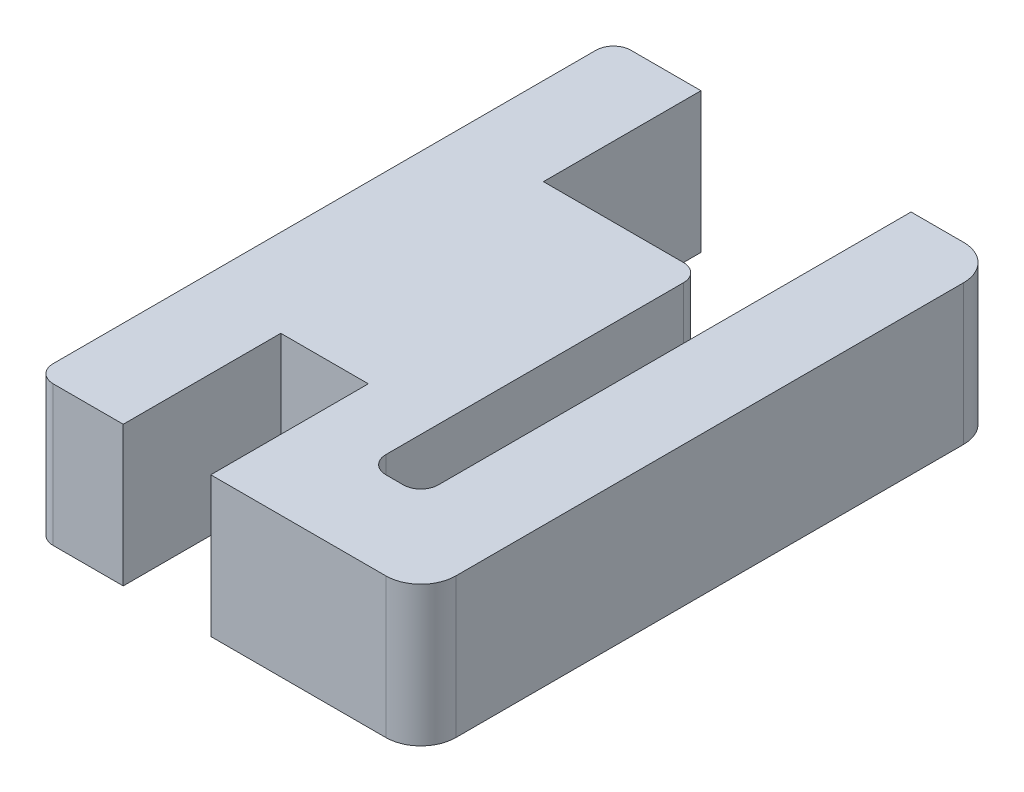
ISO-10303-21;
HEADER;
FILE_DESCRIPTION(('STEP AP214'),'2;1');
FILE_NAME('part.step','',(''),(''),'','','');
FILE_SCHEMA(('AUTOMOTIVE_DESIGN { 1 0 10303 214 1 1 1 1 }'));
ENDSEC;
DATA;
#1=APPLICATION_CONTEXT('core data for automotive mechanical design processes');
#2=APPLICATION_PROTOCOL_DEFINITION('international standard','automotive_design',2000,#1);
#3=PRODUCT_CONTEXT('',#1,'mechanical');
#4=PRODUCT('Part','Part','',(#3));
#5=PRODUCT_RELATED_PRODUCT_CATEGORY('part','',(#4));
#6=PRODUCT_DEFINITION_FORMATION('','',#4);
#7=PRODUCT_DEFINITION_CONTEXT('part definition',#1,'design');
#8=PRODUCT_DEFINITION('design','',#6,#7);
#9=PRODUCT_DEFINITION_SHAPE('','',#8);
#10=(LENGTH_UNIT() NAMED_UNIT(*) SI_UNIT(.MILLI.,.METRE.));
#11=(NAMED_UNIT(*) PLANE_ANGLE_UNIT() SI_UNIT($,.RADIAN.));
#12=(NAMED_UNIT(*) SI_UNIT($,.STERADIAN.) SOLID_ANGLE_UNIT());
#13=UNCERTAINTY_MEASURE_WITH_UNIT(LENGTH_MEASURE(1.E-05),#10,'distance_accuracy_value','');
#14=(GEOMETRIC_REPRESENTATION_CONTEXT(3) GLOBAL_UNCERTAINTY_ASSIGNED_CONTEXT((#13)) GLOBAL_UNIT_ASSIGNED_CONTEXT((#10,
#11,#12)) REPRESENTATION_CONTEXT('',''));
#15=CARTESIAN_POINT('',(0.,0.,0.));
#16=DIRECTION('',(0.,0.,1.));
#17=DIRECTION('',(1.,0.,0.));
#18=AXIS2_PLACEMENT_3D('',#15,#16,#17);
#19=CARTESIAN_POINT('',(0.,4.,-2.5));
#20=DIRECTION('',(0.,0.,1.));
#21=DIRECTION('',(1.,0.,0.));
#22=AXIS2_PLACEMENT_3D('',#19,#20,#21);
#23=PLANE('',#22);
#24=DIRECTION('',(-1.,0.,0.));
#25=VECTOR('',#24,1.);
#26=CARTESIAN_POINT('',(0.,4.,-2.5));
#27=LINE('',#26,#25);
#28=CARTESIAN_POINT('',(8.00000000000001,4.,-2.5));
#29=VERTEX_POINT('',#28);
#30=CARTESIAN_POINT('',(7.50000000000001,4.,-2.5));
#31=VERTEX_POINT('',#30);
#32=EDGE_CURVE('E210',#29,#31,#27,.T.);
#33=ORIENTED_EDGE('',*,*,#32,.F.);
#34=DIRECTION('',(0.,-1.,0.));
#35=VECTOR('',#34,1.);
#36=CARTESIAN_POINT('',(8.00000000000001,0.,-2.5));
#37=LINE('',#36,#35);
#38=CARTESIAN_POINT('',(8.00000000000001,0.,-2.5));
#39=VERTEX_POINT('',#38);
#40=EDGE_CURVE('E284',#29,#39,#37,.T.);
#41=ORIENTED_EDGE('',*,*,#40,.T.);
#42=DIRECTION('',(-1.,0.,0.));
#43=VECTOR('',#42,1.);
#44=CARTESIAN_POINT('',(0.,0.,-2.5));
#45=LINE('',#44,#43);
#46=CARTESIAN_POINT('',(7.50000000000001,0.,-2.5));
#47=VERTEX_POINT('',#46);
#48=EDGE_CURVE('E236',#39,#47,#45,.T.);
#49=ORIENTED_EDGE('',*,*,#48,.T.);
#50=DIRECTION('',(0.,-1.,0.));
#51=VECTOR('',#50,1.);
#52=CARTESIAN_POINT('',(7.50000000000001,4.,-2.5));
#53=LINE('',#52,#51);
#54=EDGE_CURVE('E193',#47,#31,#53,.F.);
#55=ORIENTED_EDGE('',*,*,#54,.T.);
#56=EDGE_LOOP('',(#33,#41,#49,#55));
#57=FACE_BOUND('',#56,.T.);
#58=ADVANCED_FACE('F35',(#57),#23,.F.);
#59=CARTESIAN_POINT('',(7.00000000000001,4.,0.));
#60=DIRECTION('',(-1.,0.,0.));
#61=DIRECTION('',(0.,0.,1.));
#62=AXIS2_PLACEMENT_3D('',#59,#60,#61);
#63=PLANE('',#62);
#64=DIRECTION('',(0.,0.,-1.));
#65=VECTOR('',#64,1.);
#66=CARTESIAN_POINT('',(7.00000000000001,4.,0.));
#67=LINE('',#66,#65);
#68=CARTESIAN_POINT('',(7.00000000000001,4.,-3.));
#69=VERTEX_POINT('',#68);
#70=CARTESIAN_POINT('',(7.00000000000001,4.,-11.5));
#71=VERTEX_POINT('',#70);
#72=EDGE_CURVE('E208',#69,#71,#67,.T.);
#73=ORIENTED_EDGE('',*,*,#72,.F.);
#74=DIRECTION('',(0.,-1.,0.));
#75=VECTOR('',#74,1.);
#76=CARTESIAN_POINT('',(7.00000000000001,0.,-3.));
#77=LINE('',#76,#75);
#78=CARTESIAN_POINT('',(7.00000000000001,0.,-3.));
#79=VERTEX_POINT('',#78);
#80=EDGE_CURVE('E291',#69,#79,#77,.T.);
#81=ORIENTED_EDGE('',*,*,#80,.T.);
#82=DIRECTION('',(0.,0.,-1.));
#83=VECTOR('',#82,1.);
#84=CARTESIAN_POINT('',(7.00000000000001,0.,0.));
#85=LINE('',#84,#83);
#86=CARTESIAN_POINT('',(7.00000000000001,0.,-11.5));
#87=VERTEX_POINT('',#86);
#88=EDGE_CURVE('E239',#79,#87,#85,.T.);
#89=ORIENTED_EDGE('',*,*,#88,.T.);
#90=DIRECTION('',(0.,-1.,0.));
#91=VECTOR('',#90,1.);
#92=CARTESIAN_POINT('',(7.00000000000001,4.,-11.5));
#93=LINE('',#92,#91);
#94=EDGE_CURVE('E289',#87,#71,#93,.F.);
#95=ORIENTED_EDGE('',*,*,#94,.T.);
#96=EDGE_LOOP('',(#73,#81,#89,#95));
#97=FACE_BOUND('',#96,.T.);
#98=ADVANCED_FACE('F390',(#97),#63,.F.);
#99=CARTESIAN_POINT('',(0.,4.,-12.));
#100=DIRECTION('',(0.,0.,-1.));
#101=DIRECTION('',(-1.,0.,0.));
#102=AXIS2_PLACEMENT_3D('',#99,#100,#101);
#103=PLANE('',#102);
#104=DIRECTION('',(1.,0.,0.));
#105=VECTOR('',#104,1.);
#106=CARTESIAN_POINT('',(0.,4.,-12.));
#107=LINE('',#106,#105);
#108=CARTESIAN_POINT('',(2.50000000000001,4.,-12.));
#109=VERTEX_POINT('',#108);
#110=CARTESIAN_POINT('',(6.50000000000001,4.,-12.));
#111=VERTEX_POINT('',#110);
#112=EDGE_CURVE('E186',#109,#111,#107,.T.);
#113=ORIENTED_EDGE('',*,*,#112,.T.);
#114=DIRECTION('',(0.,-1.,0.));
#115=VECTOR('',#114,1.);
#116=CARTESIAN_POINT('',(6.50000000000001,0.,-12.));
#117=LINE('',#116,#115);
#118=CARTESIAN_POINT('',(6.50000000000001,0.,-12.));
#119=VERTEX_POINT('',#118);
#120=EDGE_CURVE('E294',#111,#119,#117,.T.);
#121=ORIENTED_EDGE('',*,*,#120,.T.);
#122=DIRECTION('',(1.,0.,0.));
#123=VECTOR('',#122,1.);
#124=CARTESIAN_POINT('',(0.,0.,-12.));
#125=LINE('',#124,#123);
#126=CARTESIAN_POINT('',(2.50000000000001,0.,-12.));
#127=VERTEX_POINT('',#126);
#128=EDGE_CURVE('E189',#127,#119,#125,.T.);
#129=ORIENTED_EDGE('',*,*,#128,.F.);
#130=DIRECTION('',(0.,-1.,0.));
#131=VECTOR('',#130,1.);
#132=CARTESIAN_POINT('',(2.50000000000001,4.,-12.));
#133=LINE('',#132,#131);
#134=EDGE_CURVE('E181',#109,#127,#133,.T.);
#135=ORIENTED_EDGE('',*,*,#134,.F.);
#136=EDGE_LOOP('',(#113,#121,#129,#135));
#137=FACE_BOUND('',#136,.T.);
#138=ADVANCED_FACE('F183',(#137),#103,.T.);
#139=CARTESIAN_POINT('',(2.50000000000002,4.,0.));
#140=DIRECTION('',(-1.,0.,0.));
#141=DIRECTION('',(0.,0.,1.));
#142=AXIS2_PLACEMENT_3D('',#139,#140,#141);
#143=PLANE('',#142);
#144=DIRECTION('',(0.,0.,-1.));
#145=VECTOR('',#144,1.);
#146=CARTESIAN_POINT('',(2.50000000000002,0.,0.));
#147=LINE('',#146,#145);
#148=CARTESIAN_POINT('',(2.5,0.,-16.5));
#149=VERTEX_POINT('',#148);
#150=EDGE_CURVE('E243',#127,#149,#147,.T.);
#151=ORIENTED_EDGE('',*,*,#150,.T.);
#152=DIRECTION('',(0.,-1.,0.));
#153=VECTOR('',#152,1.);
#154=CARTESIAN_POINT('',(2.5,4.,-16.5));
#155=LINE('',#154,#153);
#156=CARTESIAN_POINT('',(2.5,4.,-16.5));
#157=VERTEX_POINT('',#156);
#158=EDGE_CURVE('E194',#157,#149,#155,.T.);
#159=ORIENTED_EDGE('',*,*,#158,.F.);
#160=DIRECTION('',(0.,0.,-1.));
#161=VECTOR('',#160,1.);
#162=CARTESIAN_POINT('',(2.50000000000002,4.,0.));
#163=LINE('',#162,#161);
#164=EDGE_CURVE('E198',#109,#157,#163,.T.);
#165=ORIENTED_EDGE('',*,*,#164,.F.);
#166=ORIENTED_EDGE('',*,*,#134,.T.);
#167=EDGE_LOOP('',(#151,#159,#165,#166));
#168=FACE_BOUND('',#167,.T.);
#169=ADVANCED_FACE('F199',(#168),#143,.F.);
#170=CARTESIAN_POINT('',(0.,4.,-16.5));
#171=DIRECTION('',(0.,0.,-1.));
#172=DIRECTION('',(-1.,0.,0.));
#173=AXIS2_PLACEMENT_3D('',#170,#171,#172);
#174=PLANE('',#173);
#175=DIRECTION('',(1.,0.,0.));
#176=VECTOR('',#175,1.);
#177=CARTESIAN_POINT('',(0.,0.,-16.5));
#178=LINE('',#177,#176);
#179=CARTESIAN_POINT('',(0.5,0.,-16.5));
#180=VERTEX_POINT('',#179);
#181=EDGE_CURVE('E245',#180,#149,#178,.T.);
#182=ORIENTED_EDGE('',*,*,#181,.F.);
#183=DIRECTION('',(0.,-1.,0.));
#184=VECTOR('',#183,1.);
#185=CARTESIAN_POINT('',(0.5,4.,-16.5));
#186=LINE('',#185,#184);
#187=CARTESIAN_POINT('',(0.5,4.,-16.5));
#188=VERTEX_POINT('',#187);
#189=EDGE_CURVE('E315',#180,#188,#186,.F.);
#190=ORIENTED_EDGE('',*,*,#189,.T.);
#191=DIRECTION('',(1.,0.,0.));
#192=VECTOR('',#191,1.);
#193=CARTESIAN_POINT('',(0.,4.,-16.5));
#194=LINE('',#193,#192);
#195=EDGE_CURVE('E202',#188,#157,#194,.T.);
#196=ORIENTED_EDGE('',*,*,#195,.T.);
#197=ORIENTED_EDGE('',*,*,#158,.T.);
#198=EDGE_LOOP('',(#182,#190,#196,#197));
#199=FACE_BOUND('',#198,.T.);
#200=ADVANCED_FACE('F384',(#199),#174,.T.);
#201=CARTESIAN_POINT('',(0.,4.,0.));
#202=DIRECTION('',(-1.,0.,0.));
#203=DIRECTION('',(0.,0.,1.));
#204=AXIS2_PLACEMENT_3D('',#201,#202,#203);
#205=PLANE('',#204);
#206=DIRECTION('',(0.,0.,-1.));
#207=VECTOR('',#206,1.);
#208=CARTESIAN_POINT('',(0.,0.,0.));
#209=LINE('',#208,#207);
#210=CARTESIAN_POINT('',(0.,0.,-0.5));
#211=VERTEX_POINT('',#210);
#212=CARTESIAN_POINT('',(0.,0.,-16.));
#213=VERTEX_POINT('',#212);
#214=EDGE_CURVE('E247',#211,#213,#209,.T.);
#215=ORIENTED_EDGE('',*,*,#214,.F.);
#216=DIRECTION('',(0.,-1.,0.));
#217=VECTOR('',#216,1.);
#218=CARTESIAN_POINT('',(0.,4.,-0.5));
#219=LINE('',#218,#217);
#220=CARTESIAN_POINT('',(0.,4.,-0.5));
#221=VERTEX_POINT('',#220);
#222=EDGE_CURVE('E313',#211,#221,#219,.F.);
#223=ORIENTED_EDGE('',*,*,#222,.T.);
#224=DIRECTION('',(0.,0.,-1.));
#225=VECTOR('',#224,1.);
#226=CARTESIAN_POINT('',(0.,4.,0.));
#227=LINE('',#226,#225);
#228=CARTESIAN_POINT('',(0.,4.,-16.));
#229=VERTEX_POINT('',#228);
#230=EDGE_CURVE('E215',#221,#229,#227,.T.);
#231=ORIENTED_EDGE('',*,*,#230,.T.);
#232=DIRECTION('',(0.,-1.,0.));
#233=VECTOR('',#232,1.);
#234=CARTESIAN_POINT('',(0.,4.,-16.));
#235=LINE('',#234,#233);
#236=EDGE_CURVE('E310',#229,#213,#235,.T.);
#237=ORIENTED_EDGE('',*,*,#236,.T.);
#238=EDGE_LOOP('',(#215,#223,#231,#237));
#239=FACE_BOUND('',#238,.T.);
#240=ADVANCED_FACE('F373',(#239),#205,.T.);
#241=CARTESIAN_POINT('',(0.,4.,0.));
#242=DIRECTION('',(0.,0.,-1.));
#243=DIRECTION('',(-1.,0.,0.));
#244=AXIS2_PLACEMENT_3D('',#241,#242,#243);
#245=PLANE('',#244);
#246=DIRECTION('',(1.,0.,0.));
#247=VECTOR('',#246,1.);
#248=CARTESIAN_POINT('',(0.,4.,0.));
#249=LINE('',#248,#247);
#250=CARTESIAN_POINT('',(0.5,4.,0.));
#251=VERTEX_POINT('',#250);
#252=CARTESIAN_POINT('',(2.5,4.,0.));
#253=VERTEX_POINT('',#252);
#254=EDGE_CURVE('E218',#251,#253,#249,.T.);
#255=ORIENTED_EDGE('',*,*,#254,.F.);
#256=DIRECTION('',(0.,-1.,0.));
#257=VECTOR('',#256,1.);
#258=CARTESIAN_POINT('',(0.5,0.,0.));
#259=LINE('',#258,#257);
#260=CARTESIAN_POINT('',(0.5,0.,0.));
#261=VERTEX_POINT('',#260);
#262=EDGE_CURVE('E307',#251,#261,#259,.T.);
#263=ORIENTED_EDGE('',*,*,#262,.T.);
#264=DIRECTION('',(1.,0.,0.));
#265=VECTOR('',#264,1.);
#266=CARTESIAN_POINT('',(0.,0.,0.));
#267=LINE('',#266,#265);
#268=CARTESIAN_POINT('',(2.5,0.,0.));
#269=VERTEX_POINT('',#268);
#270=EDGE_CURVE('E250',#261,#269,#267,.T.);
#271=ORIENTED_EDGE('',*,*,#270,.T.);
#272=DIRECTION('',(0.,-1.,0.));
#273=VECTOR('',#272,1.);
#274=CARTESIAN_POINT('',(2.5,4.,0.));
#275=LINE('',#274,#273);
#276=EDGE_CURVE('E279',#253,#269,#275,.T.);
#277=ORIENTED_EDGE('',*,*,#276,.F.);
#278=EDGE_LOOP('',(#255,#263,#271,#277));
#279=FACE_BOUND('',#278,.T.);
#280=ADVANCED_FACE('F367',(#279),#245,.F.);
#281=CARTESIAN_POINT('',(2.5,4.,0.));
#282=DIRECTION('',(-1.,0.,0.));
#283=DIRECTION('',(0.,0.,1.));
#284=AXIS2_PLACEMENT_3D('',#281,#282,#283);
#285=PLANE('',#284);
#286=DIRECTION('',(0.,0.,-1.));
#287=VECTOR('',#286,1.);
#288=CARTESIAN_POINT('',(2.5,0.,0.));
#289=LINE('',#288,#287);
#290=CARTESIAN_POINT('',(2.50000000000001,0.,-4.5));
#291=VERTEX_POINT('',#290);
#292=EDGE_CURVE('E252',#269,#291,#289,.T.);
#293=ORIENTED_EDGE('',*,*,#292,.T.);
#294=DIRECTION('',(0.,-1.,0.));
#295=VECTOR('',#294,1.);
#296=CARTESIAN_POINT('',(2.50000000000001,4.,-4.5));
#297=LINE('',#296,#295);
#298=CARTESIAN_POINT('',(2.50000000000001,4.,-4.5));
#299=VERTEX_POINT('',#298);
#300=EDGE_CURVE('E276',#299,#291,#297,.T.);
#301=ORIENTED_EDGE('',*,*,#300,.F.);
#302=DIRECTION('',(0.,0.,-1.));
#303=VECTOR('',#302,1.);
#304=CARTESIAN_POINT('',(2.5,4.,0.));
#305=LINE('',#304,#303);
#306=EDGE_CURVE('E220',#253,#299,#305,.T.);
#307=ORIENTED_EDGE('',*,*,#306,.F.);
#308=ORIENTED_EDGE('',*,*,#276,.T.);
#309=EDGE_LOOP('',(#293,#301,#307,#308));
#310=FACE_BOUND('',#309,.T.);
#311=ADVANCED_FACE('F363',(#310),#285,.F.);
#312=CARTESIAN_POINT('',(0.,4.,-4.5));
#313=DIRECTION('',(0.,0.,-1.));
#314=DIRECTION('',(-1.,0.,0.));
#315=AXIS2_PLACEMENT_3D('',#312,#313,#314);
#316=PLANE('',#315);
#317=DIRECTION('',(1.,0.,0.));
#318=VECTOR('',#317,1.);
#319=CARTESIAN_POINT('',(0.,0.,-4.5));
#320=LINE('',#319,#318);
#321=CARTESIAN_POINT('',(5.00000000000001,0.,-4.5));
#322=VERTEX_POINT('',#321);
#323=EDGE_CURVE('E254',#291,#322,#320,.T.);
#324=ORIENTED_EDGE('',*,*,#323,.T.);
#325=DIRECTION('',(0.,-1.,0.));
#326=VECTOR('',#325,1.);
#327=CARTESIAN_POINT('',(5.00000000000001,4.,-4.5));
#328=LINE('',#327,#326);
#329=CARTESIAN_POINT('',(5.00000000000001,4.,-4.5));
#330=VERTEX_POINT('',#329);
#331=EDGE_CURVE('E273',#330,#322,#328,.T.);
#332=ORIENTED_EDGE('',*,*,#331,.F.);
#333=DIRECTION('',(1.,0.,0.));
#334=VECTOR('',#333,1.);
#335=CARTESIAN_POINT('',(0.,4.,-4.5));
#336=LINE('',#335,#334);
#337=EDGE_CURVE('E222',#299,#330,#336,.T.);
#338=ORIENTED_EDGE('',*,*,#337,.F.);
#339=ORIENTED_EDGE('',*,*,#300,.T.);
#340=EDGE_LOOP('',(#324,#332,#338,#339));
#341=FACE_BOUND('',#340,.T.);
#342=ADVANCED_FACE('F358',(#341),#316,.F.);
#343=CARTESIAN_POINT('',(5.00000000000001,4.,0.));
#344=DIRECTION('',(1.,0.,0.));
#345=DIRECTION('',(0.,0.,-1.));
#346=AXIS2_PLACEMENT_3D('',#343,#344,#345);
#347=PLANE('',#346);
#348=DIRECTION('',(0.,0.,1.));
#349=VECTOR('',#348,1.);
#350=CARTESIAN_POINT('',(5.00000000000001,0.,0.));
#351=LINE('',#350,#349);
#352=CARTESIAN_POINT('',(5.00000000000001,0.,0.));
#353=VERTEX_POINT('',#352);
#354=EDGE_CURVE('E256',#322,#353,#351,.T.);
#355=ORIENTED_EDGE('',*,*,#354,.T.);
#356=DIRECTION('',(0.,-1.,0.));
#357=VECTOR('',#356,1.);
#358=CARTESIAN_POINT('',(5.00000000000001,4.,0.));
#359=LINE('',#358,#357);
#360=CARTESIAN_POINT('',(5.00000000000001,4.,0.));
#361=VERTEX_POINT('',#360);
#362=EDGE_CURVE('E270',#361,#353,#359,.T.);
#363=ORIENTED_EDGE('',*,*,#362,.F.);
#364=DIRECTION('',(0.,0.,1.));
#365=VECTOR('',#364,1.);
#366=CARTESIAN_POINT('',(5.00000000000001,4.,0.));
#367=LINE('',#366,#365);
#368=EDGE_CURVE('E224',#330,#361,#367,.T.);
#369=ORIENTED_EDGE('',*,*,#368,.F.);
#370=ORIENTED_EDGE('',*,*,#331,.T.);
#371=EDGE_LOOP('',(#355,#363,#369,#370));
#372=FACE_BOUND('',#371,.T.);
#373=ADVANCED_FACE('F352',(#372),#347,.F.);
#374=CARTESIAN_POINT('',(0.,4.,0.));
#375=DIRECTION('',(0.,0.,-1.));
#376=DIRECTION('',(-1.,0.,0.));
#377=AXIS2_PLACEMENT_3D('',#374,#375,#376);
#378=PLANE('',#377);
#379=DIRECTION('',(1.,0.,0.));
#380=VECTOR('',#379,1.);
#381=CARTESIAN_POINT('',(0.,0.,0.));
#382=LINE('',#381,#380);
#383=CARTESIAN_POINT('',(10.,0.,0.));
#384=VERTEX_POINT('',#383);
#385=EDGE_CURVE('E258',#353,#384,#382,.T.);
#386=ORIENTED_EDGE('',*,*,#385,.T.);
#387=DIRECTION('',(0.,-1.,0.));
#388=VECTOR('',#387,1.);
#389=CARTESIAN_POINT('',(10.,4.,0.));
#390=LINE('',#389,#388);
#391=CARTESIAN_POINT('',(10.,4.,0.));
#392=VERTEX_POINT('',#391);
#393=EDGE_CURVE('E58',#384,#392,#390,.F.);
#394=ORIENTED_EDGE('',*,*,#393,.T.);
#395=DIRECTION('',(1.,0.,0.));
#396=VECTOR('',#395,1.);
#397=CARTESIAN_POINT('',(0.,4.,0.));
#398=LINE('',#397,#396);
#399=EDGE_CURVE('E226',#361,#392,#398,.T.);
#400=ORIENTED_EDGE('',*,*,#399,.F.);
#401=ORIENTED_EDGE('',*,*,#362,.T.);
#402=EDGE_LOOP('',(#386,#394,#400,#401));
#403=FACE_BOUND('',#402,.T.);
#404=ADVANCED_FACE('F348',(#403),#378,.F.);
#405=CARTESIAN_POINT('',(11.,4.,0.));
#406=DIRECTION('',(-1.,0.,0.));
#407=DIRECTION('',(0.,0.,1.));
#408=AXIS2_PLACEMENT_3D('',#405,#406,#407);
#409=PLANE('',#408);
#410=DIRECTION('',(0.,0.,-1.));
#411=VECTOR('',#410,1.);
#412=CARTESIAN_POINT('',(11.,4.,0.));
#413=LINE('',#412,#411);
#414=CARTESIAN_POINT('',(11.,4.,-1.));
#415=VERTEX_POINT('',#414);
#416=CARTESIAN_POINT('',(11.,4.,-15.5));
#417=VERTEX_POINT('',#416);
#418=EDGE_CURVE('E228',#415,#417,#413,.T.);
#419=ORIENTED_EDGE('',*,*,#418,.F.);
#420=DIRECTION('',(0.,-1.,0.));
#421=VECTOR('',#420,1.);
#422=CARTESIAN_POINT('',(11.,4.,-1.));
#423=LINE('',#422,#421);
#424=CARTESIAN_POINT('',(11.,0.,-1.));
#425=VERTEX_POINT('',#424);
#426=EDGE_CURVE('E327',#415,#425,#423,.T.);
#427=ORIENTED_EDGE('',*,*,#426,.T.);
#428=DIRECTION('',(0.,0.,-1.));
#429=VECTOR('',#428,1.);
#430=CARTESIAN_POINT('',(11.,0.,0.));
#431=LINE('',#430,#429);
#432=CARTESIAN_POINT('',(11.,0.,-15.5));
#433=VERTEX_POINT('',#432);
#434=EDGE_CURVE('E260',#425,#433,#431,.T.);
#435=ORIENTED_EDGE('',*,*,#434,.T.);
#436=DIRECTION('',(0.,-1.,0.));
#437=VECTOR('',#436,1.);
#438=CARTESIAN_POINT('',(11.,4.,-15.5));
#439=LINE('',#438,#437);
#440=EDGE_CURVE('E325',#433,#417,#439,.F.);
#441=ORIENTED_EDGE('',*,*,#440,.T.);
#442=EDGE_LOOP('',(#419,#427,#435,#441));
#443=FACE_BOUND('',#442,.T.);
#444=ADVANCED_FACE('F340',(#443),#409,.F.);
#445=CARTESIAN_POINT('',(0.,4.,-16.5));
#446=DIRECTION('',(0.,0.,1.));
#447=DIRECTION('',(1.,0.,0.));
#448=AXIS2_PLACEMENT_3D('',#445,#446,#447);
#449=PLANE('',#448);
#450=DIRECTION('',(-1.,0.,0.));
#451=VECTOR('',#450,1.);
#452=CARTESIAN_POINT('',(0.,4.,-16.5));
#453=LINE('',#452,#451);
#454=CARTESIAN_POINT('',(10.,4.,-16.5));
#455=VERTEX_POINT('',#454);
#456=CARTESIAN_POINT('',(8.50000000000001,4.,-16.5));
#457=VERTEX_POINT('',#456);
#458=EDGE_CURVE('E230',#455,#457,#453,.T.);
#459=ORIENTED_EDGE('',*,*,#458,.F.);
#460=DIRECTION('',(0.,-1.,0.));
#461=VECTOR('',#460,1.);
#462=CARTESIAN_POINT('',(10.,4.,-16.5));
#463=LINE('',#462,#461);
#464=CARTESIAN_POINT('',(10.,0.,-16.5));
#465=VERTEX_POINT('',#464);
#466=EDGE_CURVE('E11',#455,#465,#463,.T.);
#467=ORIENTED_EDGE('',*,*,#466,.T.);
#468=DIRECTION('',(-1.,0.,0.));
#469=VECTOR('',#468,1.);
#470=CARTESIAN_POINT('',(0.,0.,-16.5));
#471=LINE('',#470,#469);
#472=CARTESIAN_POINT('',(8.50000000000001,0.,-16.5));
#473=VERTEX_POINT('',#472);
#474=EDGE_CURVE('E263',#465,#473,#471,.T.);
#475=ORIENTED_EDGE('',*,*,#474,.T.);
#476=DIRECTION('',(0.,-1.,0.));
#477=VECTOR('',#476,1.);
#478=CARTESIAN_POINT('',(8.50000000000001,4.,-16.5));
#479=LINE('',#478,#477);
#480=EDGE_CURVE('E235',#457,#473,#479,.T.);
#481=ORIENTED_EDGE('',*,*,#480,.F.);
#482=EDGE_LOOP('',(#459,#467,#475,#481));
#483=FACE_BOUND('',#482,.T.);
#484=ADVANCED_FACE('F434',(#483),#449,.F.);
#485=CARTESIAN_POINT('',(8.50000000000001,4.,0.));
#486=DIRECTION('',(1.,0.,0.));
#487=DIRECTION('',(0.,0.,-1.));
#488=AXIS2_PLACEMENT_3D('',#485,#486,#487);
#489=PLANE('',#488);
#490=DIRECTION('',(0.,0.,1.));
#491=VECTOR('',#490,1.);
#492=CARTESIAN_POINT('',(8.50000000000001,0.,0.));
#493=LINE('',#492,#491);
#494=CARTESIAN_POINT('',(8.50000000000001,0.,-3.));
#495=VERTEX_POINT('',#494);
#496=EDGE_CURVE('E265',#473,#495,#493,.T.);
#497=ORIENTED_EDGE('',*,*,#496,.T.);
#498=DIRECTION('',(0.,-1.,0.));
#499=VECTOR('',#498,1.);
#500=CARTESIAN_POINT('',(8.50000000000001,4.,-3.));
#501=LINE('',#500,#499);
#502=CARTESIAN_POINT('',(8.50000000000001,4.,-3.));
#503=VERTEX_POINT('',#502);
#504=EDGE_CURVE('E287',#495,#503,#501,.F.);
#505=ORIENTED_EDGE('',*,*,#504,.T.);
#506=DIRECTION('',(0.,0.,1.));
#507=VECTOR('',#506,1.);
#508=CARTESIAN_POINT('',(8.50000000000001,4.,0.));
#509=LINE('',#508,#507);
#510=EDGE_CURVE('E232',#457,#503,#509,.T.);
#511=ORIENTED_EDGE('',*,*,#510,.F.);
#512=ORIENTED_EDGE('',*,*,#480,.T.);
#513=EDGE_LOOP('',(#497,#505,#511,#512));
#514=FACE_BOUND('',#513,.T.);
#515=ADVANCED_FACE('F431',(#514),#489,.F.);
#516=CARTESIAN_POINT('',(0.,4.,0.));
#517=DIRECTION('',(0.,1.,0.));
#518=DIRECTION('',(0.,0.,1.));
#519=AXIS2_PLACEMENT_3D('',#516,#517,#518);
#520=PLANE('',#519);
#521=ORIENTED_EDGE('',*,*,#399,.T.);
#522=CARTESIAN_POINT('',(10.,4.,-1.));
#523=DIRECTION('',(0.,1.,0.));
#524=DIRECTION('',(0.,0.,1.));
#525=AXIS2_PLACEMENT_3D('',#522,#523,#524);
#526=CIRCLE('',#525,1.);
#527=EDGE_CURVE('E43',#392,#415,#526,.T.);
#528=ORIENTED_EDGE('',*,*,#527,.T.);
#529=ORIENTED_EDGE('',*,*,#418,.T.);
#530=CARTESIAN_POINT('',(10.,4.,-15.5));
#531=DIRECTION('',(0.,1.,0.));
#532=DIRECTION('',(0.,0.,1.));
#533=AXIS2_PLACEMENT_3D('',#530,#531,#532);
#534=CIRCLE('',#533,1.);
#535=EDGE_CURVE('E50',#417,#455,#534,.T.);
#536=ORIENTED_EDGE('',*,*,#535,.T.);
#537=ORIENTED_EDGE('',*,*,#458,.T.);
#538=ORIENTED_EDGE('',*,*,#510,.T.);
#539=CARTESIAN_POINT('',(8.00000000000001,4.,-3.));
#540=DIRECTION('',(0.,1.,0.));
#541=DIRECTION('',(0.,0.,1.));
#542=AXIS2_PLACEMENT_3D('',#539,#540,#541);
#543=CIRCLE('',#542,0.5);
#544=EDGE_CURVE('E319',#503,#29,#543,.F.);
#545=ORIENTED_EDGE('',*,*,#544,.T.);
#546=ORIENTED_EDGE('',*,*,#32,.T.);
#547=CARTESIAN_POINT('',(7.50000000000001,4.,-3.));
#548=DIRECTION('',(0.,1.,0.));
#549=DIRECTION('',(0.,0.,1.));
#550=AXIS2_PLACEMENT_3D('',#547,#548,#549);
#551=CIRCLE('',#550,0.5);
#552=EDGE_CURVE('E323',#31,#69,#551,.F.);
#553=ORIENTED_EDGE('',*,*,#552,.T.);
#554=ORIENTED_EDGE('',*,*,#72,.T.);
#555=CARTESIAN_POINT('',(6.50000000000001,4.,-11.5));
#556=DIRECTION('',(0.,1.,0.));
#557=DIRECTION('',(0.,0.,1.));
#558=AXIS2_PLACEMENT_3D('',#555,#556,#557);
#559=CIRCLE('',#558,0.5);
#560=EDGE_CURVE('E207',#71,#111,#559,.T.);
#561=ORIENTED_EDGE('',*,*,#560,.T.);
#562=ORIENTED_EDGE('',*,*,#112,.F.);
#563=ORIENTED_EDGE('',*,*,#164,.T.);
#564=ORIENTED_EDGE('',*,*,#195,.F.);
#565=CARTESIAN_POINT('',(0.5,4.,-16.));
#566=DIRECTION('',(0.,1.,0.));
#567=DIRECTION('',(0.,0.,1.));
#568=AXIS2_PLACEMENT_3D('',#565,#566,#567);
#569=CIRCLE('',#568,0.5);
#570=EDGE_CURVE('E302',#188,#229,#569,.T.);
#571=ORIENTED_EDGE('',*,*,#570,.T.);
#572=ORIENTED_EDGE('',*,*,#230,.F.);
#573=CARTESIAN_POINT('',(0.5,4.,-0.5));
#574=DIRECTION('',(0.,1.,0.));
#575=DIRECTION('',(0.,0.,1.));
#576=AXIS2_PLACEMENT_3D('',#573,#574,#575);
#577=CIRCLE('',#576,0.5);
#578=EDGE_CURVE('E304',#221,#251,#577,.T.);
#579=ORIENTED_EDGE('',*,*,#578,.T.);
#580=ORIENTED_EDGE('',*,*,#254,.T.);
#581=ORIENTED_EDGE('',*,*,#306,.T.);
#582=ORIENTED_EDGE('',*,*,#337,.T.);
#583=ORIENTED_EDGE('',*,*,#368,.T.);
#584=EDGE_LOOP('',(#521,#528,#529,#536,#537,#538,#545,#546,#553,#554,#561,#562,#563,#564,#571,
#572,#579,#580,#581,#582,#583));
#585=FACE_BOUND('',#584,.T.);
#586=ADVANCED_FACE('F204',(#585),#520,.T.);
#587=CARTESIAN_POINT('',(0.,0.,0.));
#588=DIRECTION('',(0.,1.,0.));
#589=DIRECTION('',(0.,0.,1.));
#590=AXIS2_PLACEMENT_3D('',#587,#588,#589);
#591=PLANE('',#590);
#592=ORIENTED_EDGE('',*,*,#434,.F.);
#593=CARTESIAN_POINT('',(10.,0.,-1.));
#594=DIRECTION('',(0.,1.,0.));
#595=DIRECTION('',(0.,0.,1.));
#596=AXIS2_PLACEMENT_3D('',#593,#594,#595);
#597=CIRCLE('',#596,1.);
#598=EDGE_CURVE('E332',#425,#384,#597,.F.);
#599=ORIENTED_EDGE('',*,*,#598,.T.);
#600=ORIENTED_EDGE('',*,*,#385,.F.);
#601=ORIENTED_EDGE('',*,*,#354,.F.);
#602=ORIENTED_EDGE('',*,*,#323,.F.);
#603=ORIENTED_EDGE('',*,*,#292,.F.);
#604=ORIENTED_EDGE('',*,*,#270,.F.);
#605=CARTESIAN_POINT('',(0.5,0.,-0.5));
#606=DIRECTION('',(0.,1.,0.));
#607=DIRECTION('',(0.,0.,1.));
#608=AXIS2_PLACEMENT_3D('',#605,#606,#607);
#609=CIRCLE('',#608,0.5);
#610=EDGE_CURVE('E298',#261,#211,#609,.F.);
#611=ORIENTED_EDGE('',*,*,#610,.T.);
#612=ORIENTED_EDGE('',*,*,#214,.T.);
#613=CARTESIAN_POINT('',(0.5,0.,-16.));
#614=DIRECTION('',(0.,1.,0.));
#615=DIRECTION('',(0.,0.,1.));
#616=AXIS2_PLACEMENT_3D('',#613,#614,#615);
#617=CIRCLE('',#616,0.5);
#618=EDGE_CURVE('E296',#213,#180,#617,.F.);
#619=ORIENTED_EDGE('',*,*,#618,.T.);
#620=ORIENTED_EDGE('',*,*,#181,.T.);
#621=ORIENTED_EDGE('',*,*,#150,.F.);
#622=ORIENTED_EDGE('',*,*,#128,.T.);
#623=CARTESIAN_POINT('',(6.50000000000001,0.,-11.5));
#624=DIRECTION('',(0.,1.,0.));
#625=DIRECTION('',(0.,0.,1.));
#626=AXIS2_PLACEMENT_3D('',#623,#624,#625);
#627=CIRCLE('',#626,0.5);
#628=EDGE_CURVE('E300',#119,#87,#627,.F.);
#629=ORIENTED_EDGE('',*,*,#628,.T.);
#630=ORIENTED_EDGE('',*,*,#88,.F.);
#631=CARTESIAN_POINT('',(7.50000000000001,0.,-3.));
#632=DIRECTION('',(0.,1.,0.));
#633=DIRECTION('',(0.,0.,1.));
#634=AXIS2_PLACEMENT_3D('',#631,#632,#633);
#635=CIRCLE('',#634,0.5);
#636=EDGE_CURVE('E321',#79,#47,#635,.T.);
#637=ORIENTED_EDGE('',*,*,#636,.T.);
#638=ORIENTED_EDGE('',*,*,#48,.F.);
#639=CARTESIAN_POINT('',(8.00000000000001,0.,-3.));
#640=DIRECTION('',(0.,1.,0.));
#641=DIRECTION('',(0.,0.,1.));
#642=AXIS2_PLACEMENT_3D('',#639,#640,#641);
#643=CIRCLE('',#642,0.5);
#644=EDGE_CURVE('E317',#39,#495,#643,.T.);
#645=ORIENTED_EDGE('',*,*,#644,.T.);
#646=ORIENTED_EDGE('',*,*,#496,.F.);
#647=ORIENTED_EDGE('',*,*,#474,.F.);
#648=CARTESIAN_POINT('',(10.,0.,-15.5));
#649=DIRECTION('',(0.,1.,0.));
#650=DIRECTION('',(0.,0.,1.));
#651=AXIS2_PLACEMENT_3D('',#648,#649,#650);
#652=CIRCLE('',#651,1.);
#653=EDGE_CURVE('E330',#465,#433,#652,.F.);
#654=ORIENTED_EDGE('',*,*,#653,.T.);
#655=EDGE_LOOP('',(#592,#599,#600,#601,#602,#603,#604,#611,#612,#619,#620,#621,#622,#629,#630,
#637,#638,#645,#646,#647,#654));
#656=FACE_BOUND('',#655,.T.);
#657=ADVANCED_FACE('F346',(#656),#591,.F.);
#658=CARTESIAN_POINT('',(8.00000000000001,4.,-3.));
#659=DIRECTION('',(0.,1.,0.));
#660=DIRECTION('',(0.,0.,1.));
#661=AXIS2_PLACEMENT_3D('',#658,#659,#660);
#662=CYLINDRICAL_SURFACE('',#661,0.5);
#663=ORIENTED_EDGE('',*,*,#544,.F.);
#664=ORIENTED_EDGE('',*,*,#504,.F.);
#665=ORIENTED_EDGE('',*,*,#644,.F.);
#666=ORIENTED_EDGE('',*,*,#40,.F.);
#667=EDGE_LOOP('',(#663,#664,#665,#666));
#668=FACE_BOUND('',#667,.T.);
#669=ADVANCED_FACE('F401',(#668),#662,.F.);
#670=CARTESIAN_POINT('',(7.50000000000001,4.,-3.));
#671=DIRECTION('',(0.,1.,0.));
#672=DIRECTION('',(0.,0.,1.));
#673=AXIS2_PLACEMENT_3D('',#670,#671,#672);
#674=CYLINDRICAL_SURFACE('',#673,0.5);
#675=ORIENTED_EDGE('',*,*,#552,.F.);
#676=ORIENTED_EDGE('',*,*,#54,.F.);
#677=ORIENTED_EDGE('',*,*,#636,.F.);
#678=ORIENTED_EDGE('',*,*,#80,.F.);
#679=EDGE_LOOP('',(#675,#676,#677,#678));
#680=FACE_BOUND('',#679,.T.);
#681=ADVANCED_FACE('F394',(#680),#674,.F.);
#682=CARTESIAN_POINT('',(6.50000000000001,4.,-11.5));
#683=DIRECTION('',(0.,1.,0.));
#684=DIRECTION('',(0.,0.,1.));
#685=AXIS2_PLACEMENT_3D('',#682,#683,#684);
#686=CYLINDRICAL_SURFACE('',#685,0.5);
#687=ORIENTED_EDGE('',*,*,#560,.F.);
#688=ORIENTED_EDGE('',*,*,#94,.F.);
#689=ORIENTED_EDGE('',*,*,#628,.F.);
#690=ORIENTED_EDGE('',*,*,#120,.F.);
#691=EDGE_LOOP('',(#687,#688,#689,#690));
#692=FACE_BOUND('',#691,.T.);
#693=ADVANCED_FACE('F392',(#692),#686,.T.);
#694=CARTESIAN_POINT('',(0.5,4.,-0.5));
#695=DIRECTION('',(0.,1.,0.));
#696=DIRECTION('',(0.,0.,1.));
#697=AXIS2_PLACEMENT_3D('',#694,#695,#696);
#698=CYLINDRICAL_SURFACE('',#697,0.5);
#699=ORIENTED_EDGE('',*,*,#578,.F.);
#700=ORIENTED_EDGE('',*,*,#222,.F.);
#701=ORIENTED_EDGE('',*,*,#610,.F.);
#702=ORIENTED_EDGE('',*,*,#262,.F.);
#703=EDGE_LOOP('',(#699,#700,#701,#702));
#704=FACE_BOUND('',#703,.T.);
#705=ADVANCED_FACE('F377',(#704),#698,.T.);
#706=CARTESIAN_POINT('',(0.5,4.,-16.));
#707=DIRECTION('',(0.,-1.,0.));
#708=DIRECTION('',(0.,0.,-1.));
#709=AXIS2_PLACEMENT_3D('',#706,#707,#708);
#710=CYLINDRICAL_SURFACE('',#709,0.5);
#711=ORIENTED_EDGE('',*,*,#570,.F.);
#712=ORIENTED_EDGE('',*,*,#189,.F.);
#713=ORIENTED_EDGE('',*,*,#618,.F.);
#714=ORIENTED_EDGE('',*,*,#236,.F.);
#715=EDGE_LOOP('',(#711,#712,#713,#714));
#716=FACE_BOUND('',#715,.T.);
#717=ADVANCED_FACE('F380',(#716),#710,.T.);
#718=CARTESIAN_POINT('',(10.,4.,-1.));
#719=DIRECTION('',(0.,-1.,0.));
#720=DIRECTION('',(0.,0.,-1.));
#721=AXIS2_PLACEMENT_3D('',#718,#719,#720);
#722=CYLINDRICAL_SURFACE('',#721,1.);
#723=ORIENTED_EDGE('',*,*,#527,.F.);
#724=ORIENTED_EDGE('',*,*,#393,.F.);
#725=ORIENTED_EDGE('',*,*,#598,.F.);
#726=ORIENTED_EDGE('',*,*,#426,.F.);
#727=EDGE_LOOP('',(#723,#724,#725,#726));
#728=FACE_BOUND('',#727,.T.);
#729=ADVANCED_FACE('F343',(#728),#722,.T.);
#730=CARTESIAN_POINT('',(10.,4.,-15.5));
#731=DIRECTION('',(0.,-1.,0.));
#732=DIRECTION('',(0.,0.,-1.));
#733=AXIS2_PLACEMENT_3D('',#730,#731,#732);
#734=CYLINDRICAL_SURFACE('',#733,1.);
#735=ORIENTED_EDGE('',*,*,#535,.F.);
#736=ORIENTED_EDGE('',*,*,#440,.F.);
#737=ORIENTED_EDGE('',*,*,#653,.F.);
#738=ORIENTED_EDGE('',*,*,#466,.F.);
#739=EDGE_LOOP('',(#735,#736,#737,#738));
#740=FACE_BOUND('',#739,.T.);
#741=ADVANCED_FACE('F37',(#740),#734,.T.);
#742=CLOSED_SHELL('',(#58,#98,#138,#169,#200,#240,#280,#311,#342,#373,#404,#444,#484,#515,#586,
#657,#669,#681,#693,#705,#717,#729,#741));
#743=MANIFOLD_SOLID_BREP('B2',#742);
#744=ADVANCED_BREP_SHAPE_REPRESENTATION('',(#18,#743),#14);
#745=SHAPE_DEFINITION_REPRESENTATION(#9,#744);
ENDSEC;
END-ISO-10303-21;
